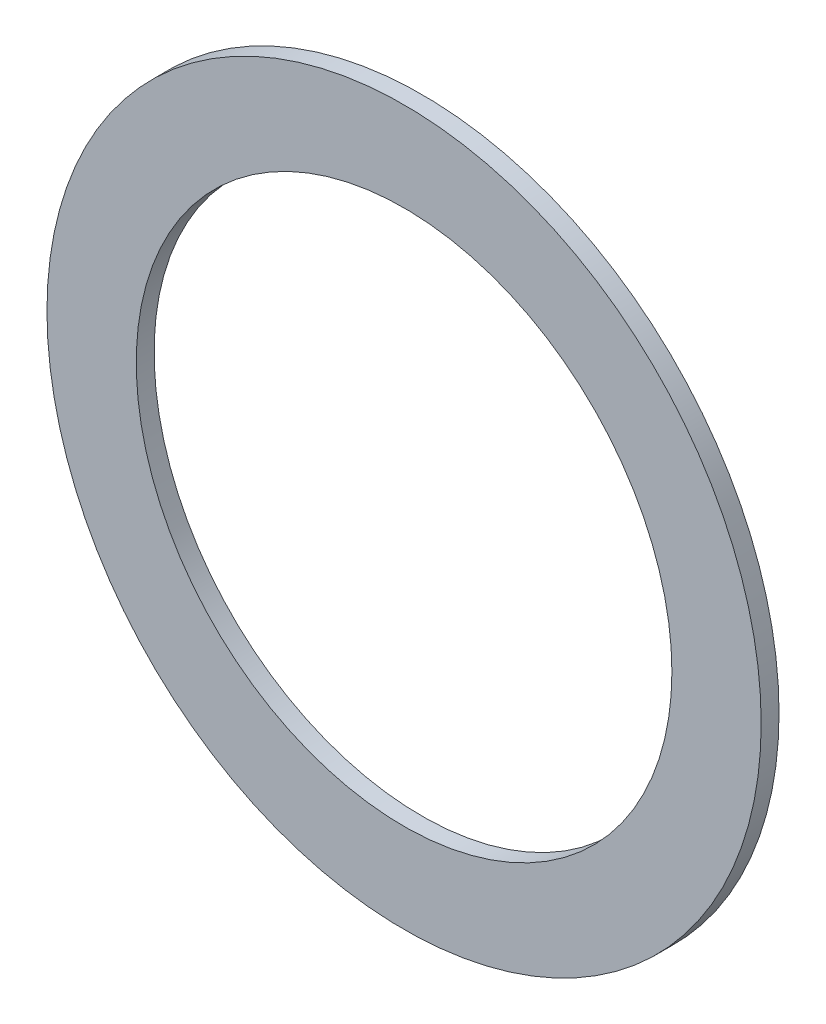
ISO-10303-21;
HEADER;
FILE_DESCRIPTION(('STEP AP214'),'2;1');
FILE_NAME('part.step','',(''),(''),'','','');
FILE_SCHEMA(('AUTOMOTIVE_DESIGN { 1 0 10303 214 1 1 1 1 }'));
ENDSEC;
DATA;
#1=APPLICATION_CONTEXT('core data for automotive mechanical design processes');
#2=APPLICATION_PROTOCOL_DEFINITION('international standard','automotive_design',2000,#1);
#3=PRODUCT_CONTEXT('',#1,'mechanical');
#4=PRODUCT('Part','Part','',(#3));
#5=PRODUCT_RELATED_PRODUCT_CATEGORY('part','',(#4));
#6=PRODUCT_DEFINITION_FORMATION('','',#4);
#7=PRODUCT_DEFINITION_CONTEXT('part definition',#1,'design');
#8=PRODUCT_DEFINITION('design','',#6,#7);
#9=PRODUCT_DEFINITION_SHAPE('','',#8);
#10=(LENGTH_UNIT() NAMED_UNIT(*) SI_UNIT(.MILLI.,.METRE.));
#11=(NAMED_UNIT(*) PLANE_ANGLE_UNIT() SI_UNIT($,.RADIAN.));
#12=(NAMED_UNIT(*) SI_UNIT($,.STERADIAN.) SOLID_ANGLE_UNIT());
#13=UNCERTAINTY_MEASURE_WITH_UNIT(LENGTH_MEASURE(1.E-05),#10,'distance_accuracy_value','');
#14=(GEOMETRIC_REPRESENTATION_CONTEXT(3) GLOBAL_UNCERTAINTY_ASSIGNED_CONTEXT((#13)) GLOBAL_UNIT_ASSIGNED_CONTEXT((#10,
#11,#12)) REPRESENTATION_CONTEXT('',''));
#15=CARTESIAN_POINT('',(0.,0.,0.));
#16=DIRECTION('',(0.,0.,1.));
#17=DIRECTION('',(1.,0.,0.));
#18=AXIS2_PLACEMENT_3D('',#15,#16,#17);
#19=CARTESIAN_POINT('',(0.,0.,5.));
#20=DIRECTION('',(0.,0.,-1.));
#21=DIRECTION('',(-1.,0.,0.));
#22=AXIS2_PLACEMENT_3D('',#19,#20,#21);
#23=CYLINDRICAL_SURFACE('',#22,100.);
#24=CARTESIAN_POINT('',(0.,0.,5.));
#25=DIRECTION('',(0.,0.,1.));
#26=DIRECTION('',(1.,0.,0.));
#27=AXIS2_PLACEMENT_3D('',#24,#25,#26);
#28=CIRCLE('',#27,100.);
#29=CARTESIAN_POINT('',(100.,0.,5.));
#30=VERTEX_POINT('',#29);
#31=EDGE_CURVE('E10',#30,#30,#28,.T.);
#32=ORIENTED_EDGE('',*,*,#31,.F.);
#33=EDGE_LOOP('',(#32));
#34=FACE_BOUND('',#33,.T.);
#35=CARTESIAN_POINT('',(0.,0.,0.));
#36=DIRECTION('',(0.,0.,1.));
#37=DIRECTION('',(1.,0.,0.));
#38=AXIS2_PLACEMENT_3D('',#35,#36,#37);
#39=CIRCLE('',#38,100.);
#40=CARTESIAN_POINT('',(100.,0.,0.));
#41=VERTEX_POINT('',#40);
#42=EDGE_CURVE('E34',#41,#41,#39,.T.);
#43=ORIENTED_EDGE('',*,*,#42,.T.);
#44=EDGE_LOOP('',(#43));
#45=FACE_BOUND('',#44,.T.);
#46=ADVANCED_FACE('F31',(#34,#45),#23,.T.);
#47=CARTESIAN_POINT('',(0.,0.,5.));
#48=DIRECTION('',(0.,0.,1.));
#49=DIRECTION('',(1.,0.,0.));
#50=AXIS2_PLACEMENT_3D('',#47,#48,#49);
#51=PLANE('',#50);
#52=CARTESIAN_POINT('',(0.,0.,5.));
#53=DIRECTION('',(0.,0.,1.));
#54=DIRECTION('',(1.,0.,0.));
#55=AXIS2_PLACEMENT_3D('',#52,#53,#54);
#56=CIRCLE('',#55,75.);
#57=CARTESIAN_POINT('',(75.,0.,5.));
#58=VERTEX_POINT('',#57);
#59=EDGE_CURVE('E43',#58,#58,#56,.T.);
#60=ORIENTED_EDGE('',*,*,#59,.F.);
#61=EDGE_LOOP('',(#60));
#62=FACE_BOUND('',#61,.T.);
#63=ORIENTED_EDGE('',*,*,#31,.T.);
#64=EDGE_LOOP('',(#63));
#65=FACE_BOUND('',#64,.T.);
#66=ADVANCED_FACE('F58',(#62,#65),#51,.T.);
#67=CARTESIAN_POINT('',(0.,0.,0.));
#68=DIRECTION('',(0.,0.,1.));
#69=DIRECTION('',(1.,0.,0.));
#70=AXIS2_PLACEMENT_3D('',#67,#68,#69);
#71=PLANE('',#70);
#72=CARTESIAN_POINT('',(0.,0.,0.));
#73=DIRECTION('',(0.,0.,1.));
#74=DIRECTION('',(1.,0.,0.));
#75=AXIS2_PLACEMENT_3D('',#72,#73,#74);
#76=CIRCLE('',#75,75.);
#77=CARTESIAN_POINT('',(75.,0.,0.));
#78=VERTEX_POINT('',#77);
#79=EDGE_CURVE('E41',#78,#78,#76,.T.);
#80=ORIENTED_EDGE('',*,*,#79,.T.);
#81=EDGE_LOOP('',(#80));
#82=FACE_BOUND('',#81,.T.);
#83=ORIENTED_EDGE('',*,*,#42,.F.);
#84=EDGE_LOOP('',(#83));
#85=FACE_BOUND('',#84,.T.);
#86=ADVANCED_FACE('F49',(#82,#85),#71,.F.);
#87=CARTESIAN_POINT('',(0.,0.,0.));
#88=DIRECTION('',(0.,0.,1.));
#89=DIRECTION('',(1.,0.,0.));
#90=AXIS2_PLACEMENT_3D('',#87,#88,#89);
#91=CYLINDRICAL_SURFACE('',#90,75.);
#92=ORIENTED_EDGE('',*,*,#79,.F.);
#93=EDGE_LOOP('',(#92));
#94=FACE_BOUND('',#93,.T.);
#95=ORIENTED_EDGE('',*,*,#59,.T.);
#96=EDGE_LOOP('',(#95));
#97=FACE_BOUND('',#96,.T.);
#98=ADVANCED_FACE('F52',(#94,#97),#91,.F.);
#99=CLOSED_SHELL('',(#46,#66,#86,#98));
#100=MANIFOLD_SOLID_BREP('B2',#99);
#101=ADVANCED_BREP_SHAPE_REPRESENTATION('',(#18,#100),#14);
#102=SHAPE_DEFINITION_REPRESENTATION(#9,#101);
ENDSEC;
END-ISO-10303-21;
